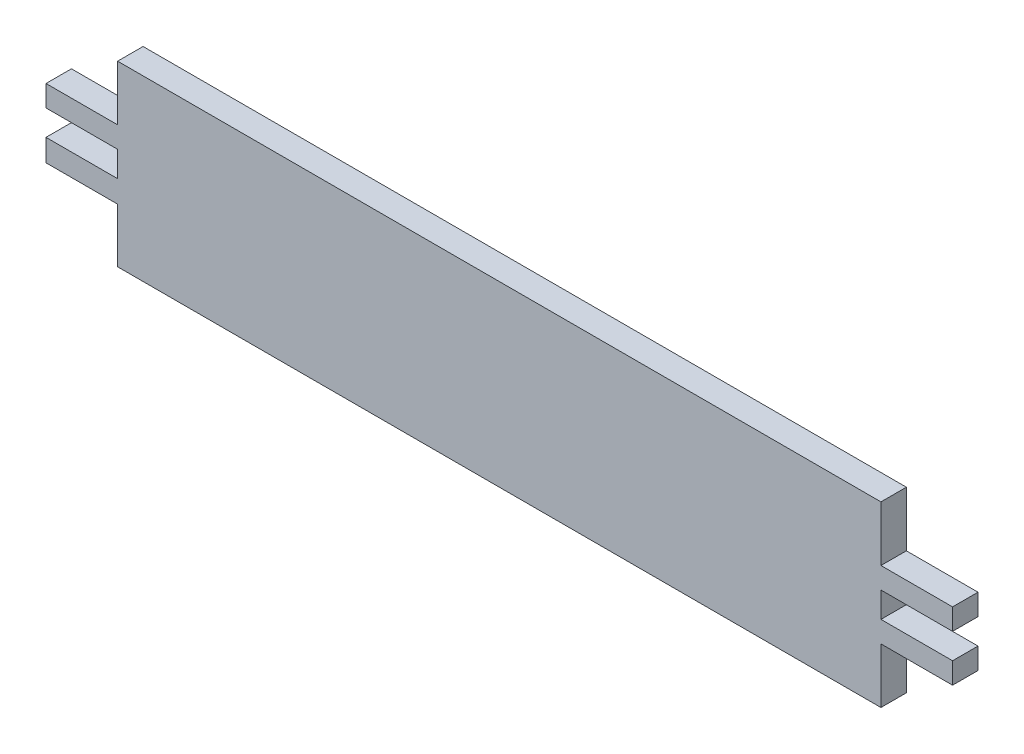
ISO-10303-21;
HEADER;
FILE_DESCRIPTION(('STEP AP214'),'2;1');
FILE_NAME('part.step','',(''),(''),'','','');
FILE_SCHEMA(('AUTOMOTIVE_DESIGN { 1 0 10303 214 1 1 1 1 }'));
ENDSEC;
DATA;
#1=APPLICATION_CONTEXT('core data for automotive mechanical design processes');
#2=APPLICATION_PROTOCOL_DEFINITION('international standard','automotive_design',2000,#1);
#3=PRODUCT_CONTEXT('',#1,'mechanical');
#4=PRODUCT('Part','Part','',(#3));
#5=PRODUCT_RELATED_PRODUCT_CATEGORY('part','',(#4));
#6=PRODUCT_DEFINITION_FORMATION('','',#4);
#7=PRODUCT_DEFINITION_CONTEXT('part definition',#1,'design');
#8=PRODUCT_DEFINITION('design','',#6,#7);
#9=PRODUCT_DEFINITION_SHAPE('','',#8);
#10=(LENGTH_UNIT() NAMED_UNIT(*) SI_UNIT(.MILLI.,.METRE.));
#11=(NAMED_UNIT(*) PLANE_ANGLE_UNIT() SI_UNIT($,.RADIAN.));
#12=(NAMED_UNIT(*) SI_UNIT($,.STERADIAN.) SOLID_ANGLE_UNIT());
#13=UNCERTAINTY_MEASURE_WITH_UNIT(LENGTH_MEASURE(1.E-05),#10,'distance_accuracy_value','');
#14=(GEOMETRIC_REPRESENTATION_CONTEXT(3) GLOBAL_UNCERTAINTY_ASSIGNED_CONTEXT((#13)) GLOBAL_UNIT_ASSIGNED_CONTEXT((#10,
#11,#12)) REPRESENTATION_CONTEXT('',''));
#15=CARTESIAN_POINT('',(0.,0.,0.));
#16=DIRECTION('',(0.,0.,1.));
#17=DIRECTION('',(1.,0.,0.));
#18=AXIS2_PLACEMENT_3D('',#15,#16,#17);
#19=CARTESIAN_POINT('',(-59.917123056119,16.2044558603052,6.));
#20=DIRECTION('',(1.,0.,0.));
#21=DIRECTION('',(0.,0.,-1.));
#22=AXIS2_PLACEMENT_3D('',#19,#20,#21);
#23=PLANE('',#22);
#24=DIRECTION('',(0.,-1.,0.));
#25=VECTOR('',#24,1.);
#26=CARTESIAN_POINT('',(-59.917123056119,16.2044558603052,0.));
#27=LINE('',#26,#25);
#28=CARTESIAN_POINT('',(-59.917123056119,29.2044558603051,0.));
#29=VERTEX_POINT('',#28);
#30=CARTESIAN_POINT('',(-59.917123056119,16.2044558603052,0.));
#31=VERTEX_POINT('',#30);
#32=EDGE_CURVE('E212',#29,#31,#27,.T.);
#33=ORIENTED_EDGE('',*,*,#32,.T.);
#34=DIRECTION('',(0.,0.,-1.));
#35=VECTOR('',#34,1.);
#36=CARTESIAN_POINT('',(-59.917123056119,16.2044558603052,6.));
#37=LINE('',#36,#35);
#38=CARTESIAN_POINT('',(-59.917123056119,16.2044558603052,6.));
#39=VERTEX_POINT('',#38);
#40=EDGE_CURVE('E11',#39,#31,#37,.T.);
#41=ORIENTED_EDGE('',*,*,#40,.F.);
#42=DIRECTION('',(0.,-1.,0.));
#43=VECTOR('',#42,1.);
#44=CARTESIAN_POINT('',(-59.917123056119,16.2044558603052,6.));
#45=LINE('',#44,#43);
#46=CARTESIAN_POINT('',(-59.917123056119,29.2044558603051,6.));
#47=VERTEX_POINT('',#46);
#48=EDGE_CURVE('E270',#47,#39,#45,.T.);
#49=ORIENTED_EDGE('',*,*,#48,.F.);
#50=DIRECTION('',(0.,0.,-1.));
#51=VECTOR('',#50,1.);
#52=CARTESIAN_POINT('',(-59.917123056119,29.2044558603051,6.));
#53=LINE('',#52,#51);
#54=EDGE_CURVE('E208',#47,#29,#53,.T.);
#55=ORIENTED_EDGE('',*,*,#54,.T.);
#56=EDGE_LOOP('',(#33,#41,#49,#55));
#57=FACE_BOUND('',#56,.T.);
#58=ADVANCED_FACE('F39',(#57),#23,.F.);
#59=CARTESIAN_POINT('',(-76.807123056119,16.2044558603052,6.));
#60=DIRECTION('',(0.,-1.,0.));
#61=DIRECTION('',(0.,0.,-1.));
#62=AXIS2_PLACEMENT_3D('',#59,#60,#61);
#63=PLANE('',#62);
#64=DIRECTION('',(-1.,0.,0.));
#65=VECTOR('',#64,1.);
#66=CARTESIAN_POINT('',(-76.807123056119,16.2044558603052,0.));
#67=LINE('',#66,#65);
#68=CARTESIAN_POINT('',(-76.807123056119,16.2044558603052,0.));
#69=VERTEX_POINT('',#68);
#70=EDGE_CURVE('E216',#31,#69,#67,.T.);
#71=ORIENTED_EDGE('',*,*,#70,.T.);
#72=DIRECTION('',(0.,0.,-1.));
#73=VECTOR('',#72,1.);
#74=CARTESIAN_POINT('',(-76.807123056119,16.2044558603052,6.));
#75=LINE('',#74,#73);
#76=CARTESIAN_POINT('',(-76.807123056119,16.2044558603052,6.));
#77=VERTEX_POINT('',#76);
#78=EDGE_CURVE('E48',#77,#69,#75,.T.);
#79=ORIENTED_EDGE('',*,*,#78,.F.);
#80=DIRECTION('',(-1.,0.,0.));
#81=VECTOR('',#80,1.);
#82=CARTESIAN_POINT('',(-76.807123056119,16.2044558603052,6.));
#83=LINE('',#82,#81);
#84=EDGE_CURVE('E135',#39,#77,#83,.T.);
#85=ORIENTED_EDGE('',*,*,#84,.F.);
#86=ORIENTED_EDGE('',*,*,#40,.T.);
#87=EDGE_LOOP('',(#71,#79,#85,#86));
#88=FACE_BOUND('',#87,.T.);
#89=ADVANCED_FACE('F420',(#88),#63,.F.);
#90=CARTESIAN_POINT('',(-76.807123056119,11.2044558603052,6.));
#91=DIRECTION('',(1.,0.,0.));
#92=DIRECTION('',(0.,0.,-1.));
#93=AXIS2_PLACEMENT_3D('',#90,#91,#92);
#94=PLANE('',#93);
#95=DIRECTION('',(0.,-1.,0.));
#96=VECTOR('',#95,1.);
#97=CARTESIAN_POINT('',(-76.807123056119,11.2044558603052,0.));
#98=LINE('',#97,#96);
#99=CARTESIAN_POINT('',(-76.807123056119,11.2044558603052,0.));
#100=VERTEX_POINT('',#99);
#101=EDGE_CURVE('E219',#69,#100,#98,.T.);
#102=ORIENTED_EDGE('',*,*,#101,.T.);
#103=DIRECTION('',(0.,0.,-1.));
#104=VECTOR('',#103,1.);
#105=CARTESIAN_POINT('',(-76.807123056119,11.2044558603052,6.));
#106=LINE('',#105,#104);
#107=CARTESIAN_POINT('',(-76.807123056119,11.2044558603052,6.));
#108=VERTEX_POINT('',#107);
#109=EDGE_CURVE('E329',#108,#100,#106,.T.);
#110=ORIENTED_EDGE('',*,*,#109,.F.);
#111=DIRECTION('',(0.,-1.,0.));
#112=VECTOR('',#111,1.);
#113=CARTESIAN_POINT('',(-76.807123056119,11.2044558603052,6.));
#114=LINE('',#113,#112);
#115=EDGE_CURVE('E339',#77,#108,#114,.T.);
#116=ORIENTED_EDGE('',*,*,#115,.F.);
#117=ORIENTED_EDGE('',*,*,#78,.T.);
#118=EDGE_LOOP('',(#102,#110,#116,#117));
#119=FACE_BOUND('',#118,.T.);
#120=ADVANCED_FACE('F337',(#119),#94,.F.);
#121=CARTESIAN_POINT('',(-59.917123056119,11.2044558603052,6.));
#122=DIRECTION('',(0.,1.,0.));
#123=DIRECTION('',(0.,0.,1.));
#124=AXIS2_PLACEMENT_3D('',#121,#122,#123);
#125=PLANE('',#124);
#126=DIRECTION('',(1.,0.,0.));
#127=VECTOR('',#126,1.);
#128=CARTESIAN_POINT('',(-59.917123056119,11.2044558603052,0.));
#129=LINE('',#128,#127);
#130=CARTESIAN_POINT('',(-59.917123056119,11.2044558603052,0.));
#131=VERTEX_POINT('',#130);
#132=EDGE_CURVE('E222',#100,#131,#129,.T.);
#133=ORIENTED_EDGE('',*,*,#132,.T.);
#134=DIRECTION('',(0.,0.,-1.));
#135=VECTOR('',#134,1.);
#136=CARTESIAN_POINT('',(-59.917123056119,11.2044558603052,6.));
#137=LINE('',#136,#135);
#138=CARTESIAN_POINT('',(-59.917123056119,11.2044558603052,6.));
#139=VERTEX_POINT('',#138);
#140=EDGE_CURVE('E325',#139,#131,#137,.T.);
#141=ORIENTED_EDGE('',*,*,#140,.F.);
#142=DIRECTION('',(1.,0.,0.));
#143=VECTOR('',#142,1.);
#144=CARTESIAN_POINT('',(-59.917123056119,11.2044558603052,6.));
#145=LINE('',#144,#143);
#146=EDGE_CURVE('E358',#108,#139,#145,.T.);
#147=ORIENTED_EDGE('',*,*,#146,.F.);
#148=ORIENTED_EDGE('',*,*,#109,.T.);
#149=EDGE_LOOP('',(#133,#141,#147,#148));
#150=FACE_BOUND('',#149,.T.);
#151=ADVANCED_FACE('F348',(#150),#125,.F.);
#152=CARTESIAN_POINT('',(-59.917123056119,5.20445586030515,6.));
#153=DIRECTION('',(1.,0.,0.));
#154=DIRECTION('',(0.,0.,-1.));
#155=AXIS2_PLACEMENT_3D('',#152,#153,#154);
#156=PLANE('',#155);
#157=DIRECTION('',(0.,-1.,0.));
#158=VECTOR('',#157,1.);
#159=CARTESIAN_POINT('',(-59.917123056119,5.20445586030515,0.));
#160=LINE('',#159,#158);
#161=CARTESIAN_POINT('',(-59.917123056119,5.20445586030515,0.));
#162=VERTEX_POINT('',#161);
#163=EDGE_CURVE('E225',#131,#162,#160,.T.);
#164=ORIENTED_EDGE('',*,*,#163,.T.);
#165=DIRECTION('',(0.,0.,-1.));
#166=VECTOR('',#165,1.);
#167=CARTESIAN_POINT('',(-59.917123056119,5.20445586030515,6.));
#168=LINE('',#167,#166);
#169=CARTESIAN_POINT('',(-59.917123056119,5.20445586030515,6.));
#170=VERTEX_POINT('',#169);
#171=EDGE_CURVE('E321',#170,#162,#168,.T.);
#172=ORIENTED_EDGE('',*,*,#171,.F.);
#173=DIRECTION('',(0.,-1.,0.));
#174=VECTOR('',#173,1.);
#175=CARTESIAN_POINT('',(-59.917123056119,5.20445586030515,6.));
#176=LINE('',#175,#174);
#177=EDGE_CURVE('E354',#139,#170,#176,.T.);
#178=ORIENTED_EDGE('',*,*,#177,.F.);
#179=ORIENTED_EDGE('',*,*,#140,.T.);
#180=EDGE_LOOP('',(#164,#172,#178,#179));
#181=FACE_BOUND('',#180,.T.);
#182=ADVANCED_FACE('F352',(#181),#156,.F.);
#183=CARTESIAN_POINT('',(-76.807123056119,5.20445586030515,6.));
#184=DIRECTION('',(0.,-1.,0.));
#185=DIRECTION('',(0.,0.,-1.));
#186=AXIS2_PLACEMENT_3D('',#183,#184,#185);
#187=PLANE('',#186);
#188=DIRECTION('',(-1.,0.,0.));
#189=VECTOR('',#188,1.);
#190=CARTESIAN_POINT('',(-76.807123056119,5.20445586030515,0.));
#191=LINE('',#190,#189);
#192=CARTESIAN_POINT('',(-76.807123056119,5.20445586030515,0.));
#193=VERTEX_POINT('',#192);
#194=EDGE_CURVE('E228',#162,#193,#191,.T.);
#195=ORIENTED_EDGE('',*,*,#194,.T.);
#196=DIRECTION('',(0.,0.,-1.));
#197=VECTOR('',#196,1.);
#198=CARTESIAN_POINT('',(-76.807123056119,5.20445586030515,6.));
#199=LINE('',#198,#197);
#200=CARTESIAN_POINT('',(-76.807123056119,5.20445586030515,6.));
#201=VERTEX_POINT('',#200);
#202=EDGE_CURVE('E317',#201,#193,#199,.T.);
#203=ORIENTED_EDGE('',*,*,#202,.F.);
#204=DIRECTION('',(-1.,0.,0.));
#205=VECTOR('',#204,1.);
#206=CARTESIAN_POINT('',(-76.807123056119,5.20445586030515,6.));
#207=LINE('',#206,#205);
#208=EDGE_CURVE('E357',#170,#201,#207,.T.);
#209=ORIENTED_EDGE('',*,*,#208,.F.);
#210=ORIENTED_EDGE('',*,*,#171,.T.);
#211=EDGE_LOOP('',(#195,#203,#209,#210));
#212=FACE_BOUND('',#211,.T.);
#213=ADVANCED_FACE('F433',(#212),#187,.F.);
#214=CARTESIAN_POINT('',(-76.807123056119,0.,6.));
#215=DIRECTION('',(1.,0.,0.));
#216=DIRECTION('',(0.,0.,-1.));
#217=AXIS2_PLACEMENT_3D('',#214,#215,#216);
#218=PLANE('',#217);
#219=DIRECTION('',(0.,-1.,0.));
#220=VECTOR('',#219,1.);
#221=CARTESIAN_POINT('',(-76.807123056119,0.,0.));
#222=LINE('',#221,#220);
#223=CARTESIAN_POINT('',(-76.807123056119,0.,0.));
#224=VERTEX_POINT('',#223);
#225=EDGE_CURVE('E231',#193,#224,#222,.T.);
#226=ORIENTED_EDGE('',*,*,#225,.T.);
#227=DIRECTION('',(0.,0.,-1.));
#228=VECTOR('',#227,1.);
#229=CARTESIAN_POINT('',(-76.807123056119,0.,6.));
#230=LINE('',#229,#228);
#231=CARTESIAN_POINT('',(-76.807123056119,0.,6.));
#232=VERTEX_POINT('',#231);
#233=EDGE_CURVE('E313',#232,#224,#230,.T.);
#234=ORIENTED_EDGE('',*,*,#233,.F.);
#235=DIRECTION('',(0.,-1.,0.));
#236=VECTOR('',#235,1.);
#237=CARTESIAN_POINT('',(-76.807123056119,0.,6.));
#238=LINE('',#237,#236);
#239=EDGE_CURVE('E362',#201,#232,#238,.T.);
#240=ORIENTED_EDGE('',*,*,#239,.F.);
#241=ORIENTED_EDGE('',*,*,#202,.T.);
#242=EDGE_LOOP('',(#226,#234,#240,#241));
#243=FACE_BOUND('',#242,.T.);
#244=ADVANCED_FACE('F436',(#243),#218,.F.);
#245=CARTESIAN_POINT('',(-59.917123056119,0.,6.));
#246=DIRECTION('',(0.,1.,0.));
#247=DIRECTION('',(-1.,0.,0.));
#248=AXIS2_PLACEMENT_3D('',#245,#246,#247);
#249=PLANE('',#248);
#250=DIRECTION('',(1.,0.,0.));
#251=VECTOR('',#250,1.);
#252=CARTESIAN_POINT('',(-59.917123056119,0.,0.));
#253=LINE('',#252,#251);
#254=CARTESIAN_POINT('',(-59.917123056119,0.,0.));
#255=VERTEX_POINT('',#254);
#256=EDGE_CURVE('E234',#224,#255,#253,.T.);
#257=ORIENTED_EDGE('',*,*,#256,.T.);
#258=DIRECTION('',(0.,0.,-1.));
#259=VECTOR('',#258,1.);
#260=CARTESIAN_POINT('',(-59.917123056119,0.,6.));
#261=LINE('',#260,#259);
#262=CARTESIAN_POINT('',(-59.917123056119,0.,6.));
#263=VERTEX_POINT('',#262);
#264=EDGE_CURVE('E309',#263,#255,#261,.T.);
#265=ORIENTED_EDGE('',*,*,#264,.F.);
#266=DIRECTION('',(1.,0.,0.));
#267=VECTOR('',#266,1.);
#268=CARTESIAN_POINT('',(-59.917123056119,0.,6.));
#269=LINE('',#268,#267);
#270=EDGE_CURVE('E369',#232,#263,#269,.T.);
#271=ORIENTED_EDGE('',*,*,#270,.F.);
#272=ORIENTED_EDGE('',*,*,#233,.T.);
#273=EDGE_LOOP('',(#257,#265,#271,#272));
#274=FACE_BOUND('',#273,.T.);
#275=ADVANCED_FACE('F440',(#274),#249,.F.);
#276=CARTESIAN_POINT('',(-59.917123056119,-12.7955441396949,6.));
#277=DIRECTION('',(1.,0.,0.));
#278=DIRECTION('',(0.,0.,-1.));
#279=AXIS2_PLACEMENT_3D('',#276,#277,#278);
#280=PLANE('',#279);
#281=DIRECTION('',(0.,-1.,0.));
#282=VECTOR('',#281,1.);
#283=CARTESIAN_POINT('',(-59.917123056119,-12.7955441396949,0.));
#284=LINE('',#283,#282);
#285=CARTESIAN_POINT('',(-59.917123056119,-12.7955441396949,0.));
#286=VERTEX_POINT('',#285);
#287=EDGE_CURVE('E237',#255,#286,#284,.T.);
#288=ORIENTED_EDGE('',*,*,#287,.T.);
#289=DIRECTION('',(0.,0.,-1.));
#290=VECTOR('',#289,1.);
#291=CARTESIAN_POINT('',(-59.917123056119,-12.7955441396949,6.));
#292=LINE('',#291,#290);
#293=CARTESIAN_POINT('',(-59.917123056119,-12.7955441396949,6.));
#294=VERTEX_POINT('',#293);
#295=EDGE_CURVE('E305',#294,#286,#292,.T.);
#296=ORIENTED_EDGE('',*,*,#295,.F.);
#297=DIRECTION('',(0.,-1.,0.));
#298=VECTOR('',#297,1.);
#299=CARTESIAN_POINT('',(-59.917123056119,-12.7955441396949,6.));
#300=LINE('',#299,#298);
#301=EDGE_CURVE('E372',#263,#294,#300,.T.);
#302=ORIENTED_EDGE('',*,*,#301,.F.);
#303=ORIENTED_EDGE('',*,*,#264,.T.);
#304=EDGE_LOOP('',(#288,#296,#302,#303));
#305=FACE_BOUND('',#304,.T.);
#306=ADVANCED_FACE('F444',(#305),#280,.F.);
#307=CARTESIAN_POINT('',(120.082876943881,-12.7955441396949,6.));
#308=DIRECTION('',(0.,1.,0.));
#309=DIRECTION('',(0.,0.,1.));
#310=AXIS2_PLACEMENT_3D('',#307,#308,#309);
#311=PLANE('',#310);
#312=DIRECTION('',(1.,0.,0.));
#313=VECTOR('',#312,1.);
#314=CARTESIAN_POINT('',(120.082876943881,-12.7955441396949,0.));
#315=LINE('',#314,#313);
#316=CARTESIAN_POINT('',(120.082876943881,-12.7955441396949,0.));
#317=VERTEX_POINT('',#316);
#318=EDGE_CURVE('E240',#286,#317,#315,.T.);
#319=ORIENTED_EDGE('',*,*,#318,.T.);
#320=DIRECTION('',(0.,0.,-1.));
#321=VECTOR('',#320,1.);
#322=CARTESIAN_POINT('',(120.082876943881,-12.7955441396949,6.));
#323=LINE('',#322,#321);
#324=CARTESIAN_POINT('',(120.082876943881,-12.7955441396949,6.));
#325=VERTEX_POINT('',#324);
#326=EDGE_CURVE('E301',#325,#317,#323,.T.);
#327=ORIENTED_EDGE('',*,*,#326,.F.);
#328=DIRECTION('',(1.,0.,0.));
#329=VECTOR('',#328,1.);
#330=CARTESIAN_POINT('',(120.082876943881,-12.7955441396949,6.));
#331=LINE('',#330,#329);
#332=EDGE_CURVE('E375',#294,#325,#331,.T.);
#333=ORIENTED_EDGE('',*,*,#332,.F.);
#334=ORIENTED_EDGE('',*,*,#295,.T.);
#335=EDGE_LOOP('',(#319,#327,#333,#334));
#336=FACE_BOUND('',#335,.T.);
#337=ADVANCED_FACE('F448',(#336),#311,.F.);
#338=CARTESIAN_POINT('',(120.082876943881,-12.7955441396949,6.));
#339=DIRECTION('',(-1.,0.,0.));
#340=DIRECTION('',(0.,0.,1.));
#341=AXIS2_PLACEMENT_3D('',#338,#339,#340);
#342=PLANE('',#341);
#343=DIRECTION('',(0.,1.,0.));
#344=VECTOR('',#343,1.);
#345=CARTESIAN_POINT('',(120.082876943881,-12.7955441396949,0.));
#346=LINE('',#345,#344);
#347=CARTESIAN_POINT('',(120.082876943881,0.204455860305148,0.));
#348=VERTEX_POINT('',#347);
#349=EDGE_CURVE('E243',#317,#348,#346,.T.);
#350=ORIENTED_EDGE('',*,*,#349,.T.);
#351=DIRECTION('',(0.,0.,-1.));
#352=VECTOR('',#351,1.);
#353=CARTESIAN_POINT('',(120.082876943881,0.204455860305148,6.));
#354=LINE('',#353,#352);
#355=CARTESIAN_POINT('',(120.082876943881,0.204455860305148,6.));
#356=VERTEX_POINT('',#355);
#357=EDGE_CURVE('E297',#356,#348,#354,.T.);
#358=ORIENTED_EDGE('',*,*,#357,.F.);
#359=DIRECTION('',(0.,1.,0.));
#360=VECTOR('',#359,1.);
#361=CARTESIAN_POINT('',(120.082876943881,-12.7955441396949,6.));
#362=LINE('',#361,#360);
#363=EDGE_CURVE('E378',#325,#356,#362,.T.);
#364=ORIENTED_EDGE('',*,*,#363,.F.);
#365=ORIENTED_EDGE('',*,*,#326,.T.);
#366=EDGE_LOOP('',(#350,#358,#364,#365));
#367=FACE_BOUND('',#366,.T.);
#368=ADVANCED_FACE('F452',(#367),#342,.F.);
#369=CARTESIAN_POINT('',(120.082876943881,0.204455860305148,6.));
#370=DIRECTION('',(0.,1.,0.));
#371=DIRECTION('',(0.,0.,1.));
#372=AXIS2_PLACEMENT_3D('',#369,#370,#371);
#373=PLANE('',#372);
#374=DIRECTION('',(1.,0.,0.));
#375=VECTOR('',#374,1.);
#376=CARTESIAN_POINT('',(120.082876943881,0.204455860305148,0.));
#377=LINE('',#376,#375);
#378=CARTESIAN_POINT('',(136.973011288473,0.204455860305148,0.));
#379=VERTEX_POINT('',#378);
#380=EDGE_CURVE('E246',#348,#379,#377,.T.);
#381=ORIENTED_EDGE('',*,*,#380,.T.);
#382=DIRECTION('',(0.,0.,-1.));
#383=VECTOR('',#382,1.);
#384=CARTESIAN_POINT('',(136.973011288473,0.204455860305148,6.));
#385=LINE('',#384,#383);
#386=CARTESIAN_POINT('',(136.973011288473,0.204455860305148,6.));
#387=VERTEX_POINT('',#386);
#388=EDGE_CURVE('E293',#387,#379,#385,.T.);
#389=ORIENTED_EDGE('',*,*,#388,.F.);
#390=DIRECTION('',(1.,0.,0.));
#391=VECTOR('',#390,1.);
#392=CARTESIAN_POINT('',(120.082876943881,0.204455860305148,6.));
#393=LINE('',#392,#391);
#394=EDGE_CURVE('E381',#356,#387,#393,.T.);
#395=ORIENTED_EDGE('',*,*,#394,.F.);
#396=ORIENTED_EDGE('',*,*,#357,.T.);
#397=EDGE_LOOP('',(#381,#389,#395,#396));
#398=FACE_BOUND('',#397,.T.);
#399=ADVANCED_FACE('F456',(#398),#373,.F.);
#400=CARTESIAN_POINT('',(136.973011288473,0.204455860305148,6.));
#401=DIRECTION('',(-1.,0.,0.));
#402=DIRECTION('',(0.,0.,1.));
#403=AXIS2_PLACEMENT_3D('',#400,#401,#402);
#404=PLANE('',#403);
#405=DIRECTION('',(0.,1.,0.));
#406=VECTOR('',#405,1.);
#407=CARTESIAN_POINT('',(136.973011288473,0.204455860305148,0.));
#408=LINE('',#407,#406);
#409=CARTESIAN_POINT('',(136.973011288473,5.20445586030515,0.));
#410=VERTEX_POINT('',#409);
#411=EDGE_CURVE('E249',#379,#410,#408,.T.);
#412=ORIENTED_EDGE('',*,*,#411,.T.);
#413=DIRECTION('',(0.,0.,-1.));
#414=VECTOR('',#413,1.);
#415=CARTESIAN_POINT('',(136.973011288473,5.20445586030515,6.));
#416=LINE('',#415,#414);
#417=CARTESIAN_POINT('',(136.973011288473,5.20445586030515,6.));
#418=VERTEX_POINT('',#417);
#419=EDGE_CURVE('E289',#418,#410,#416,.T.);
#420=ORIENTED_EDGE('',*,*,#419,.F.);
#421=DIRECTION('',(0.,1.,0.));
#422=VECTOR('',#421,1.);
#423=CARTESIAN_POINT('',(136.973011288473,0.204455860305148,6.));
#424=LINE('',#423,#422);
#425=EDGE_CURVE('E384',#387,#418,#424,.T.);
#426=ORIENTED_EDGE('',*,*,#425,.F.);
#427=ORIENTED_EDGE('',*,*,#388,.T.);
#428=EDGE_LOOP('',(#412,#420,#426,#427));
#429=FACE_BOUND('',#428,.T.);
#430=ADVANCED_FACE('F460',(#429),#404,.F.);
#431=CARTESIAN_POINT('',(136.973011288473,5.20445586030515,6.));
#432=DIRECTION('',(0.,-1.,0.));
#433=DIRECTION('',(1.,0.,0.));
#434=AXIS2_PLACEMENT_3D('',#431,#432,#433);
#435=PLANE('',#434);
#436=DIRECTION('',(-1.,0.,0.));
#437=VECTOR('',#436,1.);
#438=CARTESIAN_POINT('',(136.973011288473,5.20445586030515,0.));
#439=LINE('',#438,#437);
#440=CARTESIAN_POINT('',(120.082876943881,5.20445586030515,0.));
#441=VERTEX_POINT('',#440);
#442=EDGE_CURVE('E252',#410,#441,#439,.T.);
#443=ORIENTED_EDGE('',*,*,#442,.T.);
#444=DIRECTION('',(0.,0.,-1.));
#445=VECTOR('',#444,1.);
#446=CARTESIAN_POINT('',(120.082876943881,5.20445586030515,6.));
#447=LINE('',#446,#445);
#448=CARTESIAN_POINT('',(120.082876943881,5.20445586030515,6.));
#449=VERTEX_POINT('',#448);
#450=EDGE_CURVE('E285',#449,#441,#447,.T.);
#451=ORIENTED_EDGE('',*,*,#450,.F.);
#452=DIRECTION('',(-1.,0.,0.));
#453=VECTOR('',#452,1.);
#454=CARTESIAN_POINT('',(136.973011288473,5.20445586030515,6.));
#455=LINE('',#454,#453);
#456=EDGE_CURVE('E387',#418,#449,#455,.T.);
#457=ORIENTED_EDGE('',*,*,#456,.F.);
#458=ORIENTED_EDGE('',*,*,#419,.T.);
#459=EDGE_LOOP('',(#443,#451,#457,#458));
#460=FACE_BOUND('',#459,.T.);
#461=ADVANCED_FACE('F464',(#460),#435,.F.);
#462=CARTESIAN_POINT('',(120.082876943881,5.20445586030515,6.));
#463=DIRECTION('',(-1.,0.,0.));
#464=DIRECTION('',(0.,0.,1.));
#465=AXIS2_PLACEMENT_3D('',#462,#463,#464);
#466=PLANE('',#465);
#467=DIRECTION('',(0.,1.,0.));
#468=VECTOR('',#467,1.);
#469=CARTESIAN_POINT('',(120.082876943881,5.20445586030515,0.));
#470=LINE('',#469,#468);
#471=CARTESIAN_POINT('',(120.082876943881,11.2044558603052,0.));
#472=VERTEX_POINT('',#471);
#473=EDGE_CURVE('E255',#441,#472,#470,.T.);
#474=ORIENTED_EDGE('',*,*,#473,.T.);
#475=DIRECTION('',(0.,0.,-1.));
#476=VECTOR('',#475,1.);
#477=CARTESIAN_POINT('',(120.082876943881,11.2044558603052,6.));
#478=LINE('',#477,#476);
#479=CARTESIAN_POINT('',(120.082876943881,11.2044558603052,6.));
#480=VERTEX_POINT('',#479);
#481=EDGE_CURVE('E281',#480,#472,#478,.T.);
#482=ORIENTED_EDGE('',*,*,#481,.F.);
#483=DIRECTION('',(0.,1.,0.));
#484=VECTOR('',#483,1.);
#485=CARTESIAN_POINT('',(120.082876943881,5.20445586030515,6.));
#486=LINE('',#485,#484);
#487=EDGE_CURVE('E390',#449,#480,#486,.T.);
#488=ORIENTED_EDGE('',*,*,#487,.F.);
#489=ORIENTED_EDGE('',*,*,#450,.T.);
#490=EDGE_LOOP('',(#474,#482,#488,#489));
#491=FACE_BOUND('',#490,.T.);
#492=ADVANCED_FACE('F468',(#491),#466,.F.);
#493=CARTESIAN_POINT('',(136.973011288473,11.2044558603052,6.));
#494=DIRECTION('',(0.,1.,0.));
#495=DIRECTION('',(0.,0.,1.));
#496=AXIS2_PLACEMENT_3D('',#493,#494,#495);
#497=PLANE('',#496);
#498=DIRECTION('',(1.,0.,0.));
#499=VECTOR('',#498,1.);
#500=CARTESIAN_POINT('',(136.973011288473,11.2044558603052,0.));
#501=LINE('',#500,#499);
#502=CARTESIAN_POINT('',(136.973011288473,11.2044558603052,0.));
#503=VERTEX_POINT('',#502);
#504=EDGE_CURVE('E258',#472,#503,#501,.T.);
#505=ORIENTED_EDGE('',*,*,#504,.T.);
#506=DIRECTION('',(0.,0.,-1.));
#507=VECTOR('',#506,1.);
#508=CARTESIAN_POINT('',(136.973011288473,11.2044558603052,6.));
#509=LINE('',#508,#507);
#510=CARTESIAN_POINT('',(136.973011288473,11.2044558603052,6.));
#511=VERTEX_POINT('',#510);
#512=EDGE_CURVE('E277',#511,#503,#509,.T.);
#513=ORIENTED_EDGE('',*,*,#512,.F.);
#514=DIRECTION('',(1.,0.,0.));
#515=VECTOR('',#514,1.);
#516=CARTESIAN_POINT('',(136.973011288473,11.2044558603052,6.));
#517=LINE('',#516,#515);
#518=EDGE_CURVE('E393',#480,#511,#517,.T.);
#519=ORIENTED_EDGE('',*,*,#518,.F.);
#520=ORIENTED_EDGE('',*,*,#481,.T.);
#521=EDGE_LOOP('',(#505,#513,#519,#520));
#522=FACE_BOUND('',#521,.T.);
#523=ADVANCED_FACE('F401',(#522),#497,.F.);
#524=CARTESIAN_POINT('',(136.973011288473,16.2044558603052,6.));
#525=DIRECTION('',(-1.,0.,0.));
#526=DIRECTION('',(0.,0.,1.));
#527=AXIS2_PLACEMENT_3D('',#524,#525,#526);
#528=PLANE('',#527);
#529=DIRECTION('',(0.,1.,0.));
#530=VECTOR('',#529,1.);
#531=CARTESIAN_POINT('',(136.973011288473,16.2044558603052,0.));
#532=LINE('',#531,#530);
#533=CARTESIAN_POINT('',(136.973011288473,16.2044558603052,0.));
#534=VERTEX_POINT('',#533);
#535=EDGE_CURVE('E261',#503,#534,#532,.T.);
#536=ORIENTED_EDGE('',*,*,#535,.T.);
#537=DIRECTION('',(0.,0.,-1.));
#538=VECTOR('',#537,1.);
#539=CARTESIAN_POINT('',(136.973011288473,16.2044558603052,6.));
#540=LINE('',#539,#538);
#541=CARTESIAN_POINT('',(136.973011288473,16.2044558603052,6.));
#542=VERTEX_POINT('',#541);
#543=EDGE_CURVE('E201',#542,#534,#540,.T.);
#544=ORIENTED_EDGE('',*,*,#543,.F.);
#545=DIRECTION('',(0.,1.,0.));
#546=VECTOR('',#545,1.);
#547=CARTESIAN_POINT('',(136.973011288473,16.2044558603052,6.));
#548=LINE('',#547,#546);
#549=EDGE_CURVE('E190',#511,#542,#548,.T.);
#550=ORIENTED_EDGE('',*,*,#549,.F.);
#551=ORIENTED_EDGE('',*,*,#512,.T.);
#552=EDGE_LOOP('',(#536,#544,#550,#551));
#553=FACE_BOUND('',#552,.T.);
#554=ADVANCED_FACE('F405',(#553),#528,.F.);
#555=CARTESIAN_POINT('',(120.082876943881,16.2044558603052,6.));
#556=DIRECTION('',(0.,-1.,0.));
#557=DIRECTION('',(0.,0.,-1.));
#558=AXIS2_PLACEMENT_3D('',#555,#556,#557);
#559=PLANE('',#558);
#560=DIRECTION('',(-1.,0.,0.));
#561=VECTOR('',#560,1.);
#562=CARTESIAN_POINT('',(120.082876943881,16.2044558603052,0.));
#563=LINE('',#562,#561);
#564=CARTESIAN_POINT('',(120.082876943881,16.2044558603052,0.));
#565=VERTEX_POINT('',#564);
#566=EDGE_CURVE('E199',#534,#565,#563,.T.);
#567=ORIENTED_EDGE('',*,*,#566,.T.);
#568=DIRECTION('',(0.,0.,-1.));
#569=VECTOR('',#568,1.);
#570=CARTESIAN_POINT('',(120.082876943881,16.2044558603052,6.));
#571=LINE('',#570,#569);
#572=CARTESIAN_POINT('',(120.082876943881,16.2044558603052,6.));
#573=VERTEX_POINT('',#572);
#574=EDGE_CURVE('E196',#573,#565,#571,.T.);
#575=ORIENTED_EDGE('',*,*,#574,.F.);
#576=DIRECTION('',(-1.,0.,0.));
#577=VECTOR('',#576,1.);
#578=CARTESIAN_POINT('',(120.082876943881,16.2044558603052,6.));
#579=LINE('',#578,#577);
#580=EDGE_CURVE('E184',#542,#573,#579,.T.);
#581=ORIENTED_EDGE('',*,*,#580,.F.);
#582=ORIENTED_EDGE('',*,*,#543,.T.);
#583=EDGE_LOOP('',(#567,#575,#581,#582));
#584=FACE_BOUND('',#583,.T.);
#585=ADVANCED_FACE('F197',(#584),#559,.F.);
#586=CARTESIAN_POINT('',(120.082876943881,29.2044558603051,6.));
#587=DIRECTION('',(-1.,0.,0.));
#588=DIRECTION('',(0.,0.,1.));
#589=AXIS2_PLACEMENT_3D('',#586,#587,#588);
#590=PLANE('',#589);
#591=DIRECTION('',(0.,1.,0.));
#592=VECTOR('',#591,1.);
#593=CARTESIAN_POINT('',(120.082876943881,29.2044558603051,0.));
#594=LINE('',#593,#592);
#595=CARTESIAN_POINT('',(120.082876943881,29.2044558603051,0.));
#596=VERTEX_POINT('',#595);
#597=EDGE_CURVE('E121',#565,#596,#594,.T.);
#598=ORIENTED_EDGE('',*,*,#597,.T.);
#599=DIRECTION('',(0.,0.,-1.));
#600=VECTOR('',#599,1.);
#601=CARTESIAN_POINT('',(120.082876943881,29.2044558603051,6.));
#602=LINE('',#601,#600);
#603=CARTESIAN_POINT('',(120.082876943881,29.2044558603051,6.));
#604=VERTEX_POINT('',#603);
#605=EDGE_CURVE('E202',#604,#596,#602,.T.);
#606=ORIENTED_EDGE('',*,*,#605,.F.);
#607=DIRECTION('',(0.,1.,0.));
#608=VECTOR('',#607,1.);
#609=CARTESIAN_POINT('',(120.082876943881,29.2044558603051,6.));
#610=LINE('',#609,#608);
#611=EDGE_CURVE('E188',#573,#604,#610,.T.);
#612=ORIENTED_EDGE('',*,*,#611,.F.);
#613=ORIENTED_EDGE('',*,*,#574,.T.);
#614=EDGE_LOOP('',(#598,#606,#612,#613));
#615=FACE_BOUND('',#614,.T.);
#616=ADVANCED_FACE('F204',(#615),#590,.F.);
#617=CARTESIAN_POINT('',(-59.917123056119,29.2044558603051,6.));
#618=DIRECTION('',(0.,-1.,0.));
#619=DIRECTION('',(0.,0.,-1.));
#620=AXIS2_PLACEMENT_3D('',#617,#618,#619);
#621=PLANE('',#620);
#622=DIRECTION('',(-1.,0.,0.));
#623=VECTOR('',#622,1.);
#624=CARTESIAN_POINT('',(-59.917123056119,29.2044558603051,0.));
#625=LINE('',#624,#623);
#626=EDGE_CURVE('E127',#596,#29,#625,.T.);
#627=ORIENTED_EDGE('',*,*,#626,.T.);
#628=ORIENTED_EDGE('',*,*,#54,.F.);
#629=DIRECTION('',(-1.,0.,0.));
#630=VECTOR('',#629,1.);
#631=CARTESIAN_POINT('',(-59.917123056119,29.2044558603051,6.));
#632=LINE('',#631,#630);
#633=EDGE_CURVE('E56',#604,#47,#632,.T.);
#634=ORIENTED_EDGE('',*,*,#633,.F.);
#635=ORIENTED_EDGE('',*,*,#605,.T.);
#636=EDGE_LOOP('',(#627,#628,#634,#635));
#637=FACE_BOUND('',#636,.T.);
#638=ADVANCED_FACE('F409',(#637),#621,.F.);
#639=CARTESIAN_POINT('',(0.,0.,6.));
#640=DIRECTION('',(0.,0.,-1.));
#641=DIRECTION('',(-1.,0.,0.));
#642=AXIS2_PLACEMENT_3D('',#639,#640,#641);
#643=PLANE('',#642);
#644=ORIENTED_EDGE('',*,*,#48,.T.);
#645=ORIENTED_EDGE('',*,*,#84,.T.);
#646=ORIENTED_EDGE('',*,*,#115,.T.);
#647=ORIENTED_EDGE('',*,*,#146,.T.);
#648=ORIENTED_EDGE('',*,*,#177,.T.);
#649=ORIENTED_EDGE('',*,*,#208,.T.);
#650=ORIENTED_EDGE('',*,*,#239,.T.);
#651=ORIENTED_EDGE('',*,*,#270,.T.);
#652=ORIENTED_EDGE('',*,*,#301,.T.);
#653=ORIENTED_EDGE('',*,*,#332,.T.);
#654=ORIENTED_EDGE('',*,*,#363,.T.);
#655=ORIENTED_EDGE('',*,*,#394,.T.);
#656=ORIENTED_EDGE('',*,*,#425,.T.);
#657=ORIENTED_EDGE('',*,*,#456,.T.);
#658=ORIENTED_EDGE('',*,*,#487,.T.);
#659=ORIENTED_EDGE('',*,*,#518,.T.);
#660=ORIENTED_EDGE('',*,*,#549,.T.);
#661=ORIENTED_EDGE('',*,*,#580,.T.);
#662=ORIENTED_EDGE('',*,*,#611,.T.);
#663=ORIENTED_EDGE('',*,*,#633,.T.);
#664=EDGE_LOOP('',(#644,#645,#646,#647,#648,#649,#650,#651,#652,#653,#654,#655,#656,#657,#658,
#659,#660,#661,#662,#663));
#665=FACE_BOUND('',#664,.T.);
#666=ADVANCED_FACE('F186',(#665),#643,.F.);
#667=CARTESIAN_POINT('',(0.,0.,0.));
#668=DIRECTION('',(0.,0.,-1.));
#669=DIRECTION('',(-1.,0.,0.));
#670=AXIS2_PLACEMENT_3D('',#667,#668,#669);
#671=PLANE('',#670);
#672=ORIENTED_EDGE('',*,*,#32,.F.);
#673=ORIENTED_EDGE('',*,*,#626,.F.);
#674=ORIENTED_EDGE('',*,*,#597,.F.);
#675=ORIENTED_EDGE('',*,*,#566,.F.);
#676=ORIENTED_EDGE('',*,*,#535,.F.);
#677=ORIENTED_EDGE('',*,*,#504,.F.);
#678=ORIENTED_EDGE('',*,*,#473,.F.);
#679=ORIENTED_EDGE('',*,*,#442,.F.);
#680=ORIENTED_EDGE('',*,*,#411,.F.);
#681=ORIENTED_EDGE('',*,*,#380,.F.);
#682=ORIENTED_EDGE('',*,*,#349,.F.);
#683=ORIENTED_EDGE('',*,*,#318,.F.);
#684=ORIENTED_EDGE('',*,*,#287,.F.);
#685=ORIENTED_EDGE('',*,*,#256,.F.);
#686=ORIENTED_EDGE('',*,*,#225,.F.);
#687=ORIENTED_EDGE('',*,*,#194,.F.);
#688=ORIENTED_EDGE('',*,*,#163,.F.);
#689=ORIENTED_EDGE('',*,*,#132,.F.);
#690=ORIENTED_EDGE('',*,*,#101,.F.);
#691=ORIENTED_EDGE('',*,*,#70,.F.);
#692=EDGE_LOOP('',(#672,#673,#674,#675,#676,#677,#678,#679,#680,#681,#682,#683,#684,#685,#686,
#687,#688,#689,#690,#691));
#693=FACE_BOUND('',#692,.T.);
#694=ADVANCED_FACE('F343',(#693),#671,.T.);
#695=CLOSED_SHELL('',(#58,#89,#120,#151,#182,#213,#244,#275,#306,#337,#368,#399,#430,#461,#492,
#523,#554,#585,#616,#638,#666,#694));
#696=MANIFOLD_SOLID_BREP('B2',#695);
#697=ADVANCED_BREP_SHAPE_REPRESENTATION('',(#18,#696),#14);
#698=SHAPE_DEFINITION_REPRESENTATION(#9,#697);
ENDSEC;
END-ISO-10303-21;
